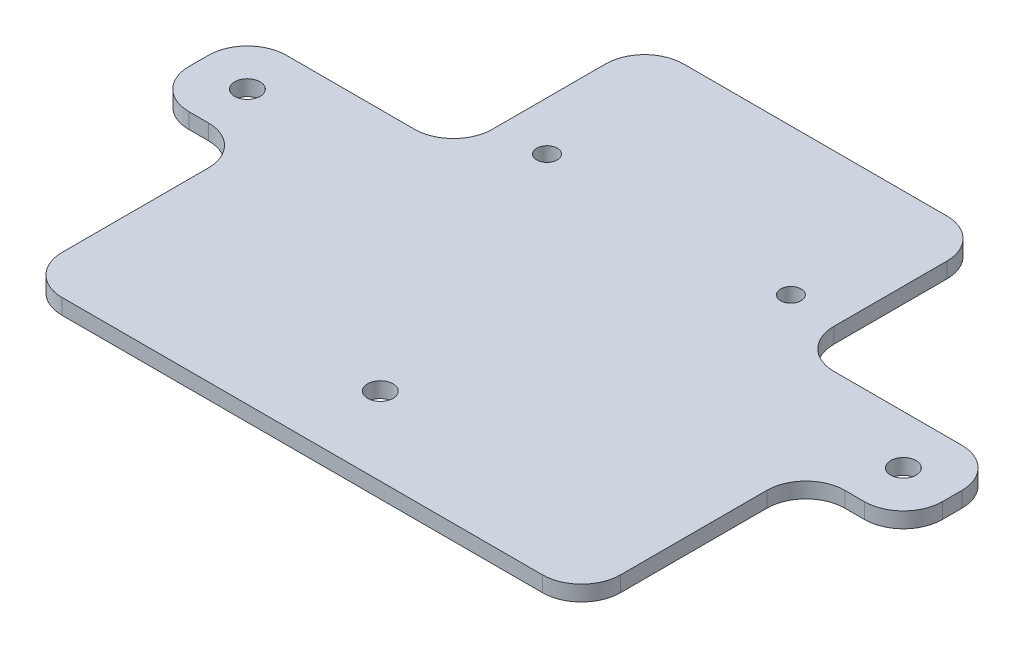
ISO-10303-21;
HEADER;
FILE_DESCRIPTION(('STEP AP214'),'2;1');
FILE_NAME('part.step','',(''),(''),'','','');
FILE_SCHEMA(('AUTOMOTIVE_DESIGN { 1 0 10303 214 1 1 1 1 }'));
ENDSEC;
DATA;
#1=APPLICATION_CONTEXT('core data for automotive mechanical design processes');
#2=APPLICATION_PROTOCOL_DEFINITION('international standard','automotive_design',2000,#1);
#3=PRODUCT_CONTEXT('',#1,'mechanical');
#4=PRODUCT('Part','Part','',(#3));
#5=PRODUCT_RELATED_PRODUCT_CATEGORY('part','',(#4));
#6=PRODUCT_DEFINITION_FORMATION('','',#4);
#7=PRODUCT_DEFINITION_CONTEXT('part definition',#1,'design');
#8=PRODUCT_DEFINITION('design','',#6,#7);
#9=PRODUCT_DEFINITION_SHAPE('','',#8);
#10=(LENGTH_UNIT() NAMED_UNIT(*) SI_UNIT(.MILLI.,.METRE.));
#11=(NAMED_UNIT(*) PLANE_ANGLE_UNIT() SI_UNIT($,.RADIAN.));
#12=(NAMED_UNIT(*) SI_UNIT($,.STERADIAN.) SOLID_ANGLE_UNIT());
#13=UNCERTAINTY_MEASURE_WITH_UNIT(LENGTH_MEASURE(1.E-05),#10,'distance_accuracy_value','');
#14=(GEOMETRIC_REPRESENTATION_CONTEXT(3) GLOBAL_UNCERTAINTY_ASSIGNED_CONTEXT((#13)) GLOBAL_UNIT_ASSIGNED_CONTEXT((#10,
#11,#12)) REPRESENTATION_CONTEXT('',''));
#15=CARTESIAN_POINT('',(0.,0.,0.));
#16=DIRECTION('',(0.,0.,1.));
#17=DIRECTION('',(1.,0.,0.));
#18=AXIS2_PLACEMENT_3D('',#15,#16,#17);
#19=CARTESIAN_POINT('',(0.,3.175,0.));
#20=DIRECTION('',(0.,1.,0.));
#21=DIRECTION('',(0.,0.,1.));
#22=AXIS2_PLACEMENT_3D('',#19,#20,#21);
#23=PLANE('',#22);
#24=CARTESIAN_POINT('',(67.25,3.175,94.175));
#25=DIRECTION('',(0.,1.,0.));
#26=DIRECTION('',(0.,0.,1.));
#27=AXIS2_PLACEMENT_3D('',#24,#25,#26);
#28=CIRCLE('',#27,2.6);
#29=CARTESIAN_POINT('',(67.25,3.175,96.775));
#30=VERTEX_POINT('',#29);
#31=EDGE_CURVE('E753',#30,#30,#28,.T.);
#32=ORIENTED_EDGE('',*,*,#31,.F.);
#33=EDGE_LOOP('',(#32));
#34=FACE_BOUND('',#33,.T.);
#35=CARTESIAN_POINT('',(25.,3.175,75.));
#36=DIRECTION('',(0.,1.,0.));
#37=DIRECTION('',(0.,0.,1.));
#38=AXIS2_PLACEMENT_3D('',#35,#36,#37);
#39=CIRCLE('',#38,2.1);
#40=CARTESIAN_POINT('',(25.,3.175,77.1));
#41=VERTEX_POINT('',#40);
#42=EDGE_CURVE('E738',#41,#41,#39,.T.);
#43=ORIENTED_EDGE('',*,*,#42,.F.);
#44=EDGE_LOOP('',(#43));
#45=FACE_BOUND('',#44,.T.);
#46=DIRECTION('',(-1.,0.,0.));
#47=VECTOR('',#46,1.);
#48=CARTESIAN_POINT('',(-35.,3.175,84.175));
#49=LINE('',#48,#47);
#50=CARTESIAN_POINT('',(-43.,3.175,84.175));
#51=VERTEX_POINT('',#50);
#52=CARTESIAN_POINT('',(-69.25,3.175,84.175));
#53=VERTEX_POINT('',#52);
#54=EDGE_CURVE('E217',#51,#53,#49,.T.);
#55=ORIENTED_EDGE('',*,*,#54,.T.);
#56=CARTESIAN_POINT('',(-69.25,3.175,92.175));
#57=DIRECTION('',(0.,1.,0.));
#58=DIRECTION('',(0.,0.,1.));
#59=AXIS2_PLACEMENT_3D('',#56,#57,#58);
#60=CIRCLE('',#59,8.);
#61=CARTESIAN_POINT('',(-77.25,3.175,92.175));
#62=VERTEX_POINT('',#61);
#63=EDGE_CURVE('E302',#53,#62,#60,.T.);
#64=ORIENTED_EDGE('',*,*,#63,.T.);
#65=DIRECTION('',(0.,0.,1.));
#66=VECTOR('',#65,1.);
#67=CARTESIAN_POINT('',(-77.25,3.175,84.175));
#68=LINE('',#67,#66);
#69=CARTESIAN_POINT('',(-77.25,3.175,96.175));
#70=VERTEX_POINT('',#69);
#71=EDGE_CURVE('E386',#62,#70,#68,.T.);
#72=ORIENTED_EDGE('',*,*,#71,.T.);
#73=CARTESIAN_POINT('',(-69.25,3.175,96.175));
#74=DIRECTION('',(0.,1.,0.));
#75=DIRECTION('',(0.,0.,1.));
#76=AXIS2_PLACEMENT_3D('',#73,#74,#75);
#77=CIRCLE('',#76,8.);
#78=CARTESIAN_POINT('',(-69.25,3.175,104.175));
#79=VERTEX_POINT('',#78);
#80=EDGE_CURVE('E300',#70,#79,#77,.T.);
#81=ORIENTED_EDGE('',*,*,#80,.T.);
#82=DIRECTION('',(1.,0.,0.));
#83=VECTOR('',#82,1.);
#84=CARTESIAN_POINT('',(-77.25,3.175,104.175));
#85=LINE('',#84,#83);
#86=CARTESIAN_POINT('',(-65.25,3.175,104.175));
#87=VERTEX_POINT('',#86);
#88=EDGE_CURVE('E389',#79,#87,#85,.T.);
#89=ORIENTED_EDGE('',*,*,#88,.T.);
#90=CARTESIAN_POINT('',(-65.25,3.175,112.175));
#91=DIRECTION('',(0.,1.,0.));
#92=DIRECTION('',(0.,0.,1.));
#93=AXIS2_PLACEMENT_3D('',#90,#91,#92);
#94=CIRCLE('',#93,8.);
#95=CARTESIAN_POINT('',(-57.25,3.175,112.175));
#96=VERTEX_POINT('',#95);
#97=EDGE_CURVE('E352',#87,#96,#94,.F.);
#98=ORIENTED_EDGE('',*,*,#97,.T.);
#99=DIRECTION('',(0.,0.,1.));
#100=VECTOR('',#99,1.);
#101=CARTESIAN_POINT('',(-57.25,3.175,104.175));
#102=LINE('',#101,#100);
#103=CARTESIAN_POINT('',(-57.25,3.175,142.175));
#104=VERTEX_POINT('',#103);
#105=EDGE_CURVE('E392',#96,#104,#102,.T.);
#106=ORIENTED_EDGE('',*,*,#105,.T.);
#107=CARTESIAN_POINT('',(-49.25,3.175,142.175));
#108=DIRECTION('',(0.,1.,0.));
#109=DIRECTION('',(0.,0.,1.));
#110=AXIS2_PLACEMENT_3D('',#107,#108,#109);
#111=CIRCLE('',#110,8.);
#112=CARTESIAN_POINT('',(-49.25,3.175,150.175));
#113=VERTEX_POINT('',#112);
#114=EDGE_CURVE('E298',#104,#113,#111,.T.);
#115=ORIENTED_EDGE('',*,*,#114,.T.);
#116=DIRECTION('',(1.,0.,0.));
#117=VECTOR('',#116,1.);
#118=CARTESIAN_POINT('',(-57.25,3.175,150.175));
#119=LINE('',#118,#117);
#120=CARTESIAN_POINT('',(49.25,3.175,150.175));
#121=VERTEX_POINT('',#120);
#122=EDGE_CURVE('E396',#113,#121,#119,.T.);
#123=ORIENTED_EDGE('',*,*,#122,.T.);
#124=CARTESIAN_POINT('',(49.25,3.175,142.175));
#125=DIRECTION('',(0.,1.,0.));
#126=DIRECTION('',(0.,0.,1.));
#127=AXIS2_PLACEMENT_3D('',#124,#125,#126);
#128=CIRCLE('',#127,8.);
#129=CARTESIAN_POINT('',(57.25,3.175,142.175));
#130=VERTEX_POINT('',#129);
#131=EDGE_CURVE('E295',#121,#130,#128,.T.);
#132=ORIENTED_EDGE('',*,*,#131,.T.);
#133=DIRECTION('',(0.,0.,-1.));
#134=VECTOR('',#133,1.);
#135=CARTESIAN_POINT('',(57.25,3.175,104.175));
#136=LINE('',#135,#134);
#137=CARTESIAN_POINT('',(57.25,3.175,112.175));
#138=VERTEX_POINT('',#137);
#139=EDGE_CURVE('E399',#130,#138,#136,.T.);
#140=ORIENTED_EDGE('',*,*,#139,.T.);
#141=CARTESIAN_POINT('',(65.25,3.175,112.175));
#142=DIRECTION('',(0.,1.,0.));
#143=DIRECTION('',(0.,0.,1.));
#144=AXIS2_PLACEMENT_3D('',#141,#142,#143);
#145=CIRCLE('',#144,8.);
#146=CARTESIAN_POINT('',(65.25,3.175,104.175));
#147=VERTEX_POINT('',#146);
#148=EDGE_CURVE('E356',#138,#147,#145,.F.);
#149=ORIENTED_EDGE('',*,*,#148,.T.);
#150=DIRECTION('',(1.,0.,0.));
#151=VECTOR('',#150,1.);
#152=CARTESIAN_POINT('',(77.25,3.175,104.175));
#153=LINE('',#152,#151);
#154=CARTESIAN_POINT('',(69.25,3.175,104.175));
#155=VERTEX_POINT('',#154);
#156=EDGE_CURVE('E403',#147,#155,#153,.T.);
#157=ORIENTED_EDGE('',*,*,#156,.T.);
#158=CARTESIAN_POINT('',(69.25,3.175,96.175));
#159=DIRECTION('',(0.,1.,0.));
#160=DIRECTION('',(0.,0.,1.));
#161=AXIS2_PLACEMENT_3D('',#158,#159,#160);
#162=CIRCLE('',#161,8.);
#163=CARTESIAN_POINT('',(77.25,3.175,96.175));
#164=VERTEX_POINT('',#163);
#165=EDGE_CURVE('E293',#155,#164,#162,.T.);
#166=ORIENTED_EDGE('',*,*,#165,.T.);
#167=DIRECTION('',(0.,0.,-1.));
#168=VECTOR('',#167,1.);
#169=CARTESIAN_POINT('',(77.25,3.175,84.175));
#170=LINE('',#169,#168);
#171=CARTESIAN_POINT('',(77.25,3.175,92.175));
#172=VERTEX_POINT('',#171);
#173=EDGE_CURVE('E406',#164,#172,#170,.T.);
#174=ORIENTED_EDGE('',*,*,#173,.T.);
#175=CARTESIAN_POINT('',(69.25,3.175,92.175));
#176=DIRECTION('',(0.,1.,0.));
#177=DIRECTION('',(0.,0.,1.));
#178=AXIS2_PLACEMENT_3D('',#175,#176,#177);
#179=CIRCLE('',#178,8.);
#180=CARTESIAN_POINT('',(69.25,3.175,84.175));
#181=VERTEX_POINT('',#180);
#182=EDGE_CURVE('E57',#172,#181,#179,.T.);
#183=ORIENTED_EDGE('',*,*,#182,.T.);
#184=DIRECTION('',(-1.,0.,0.));
#185=VECTOR('',#184,1.);
#186=CARTESIAN_POINT('',(35.,3.175,84.175));
#187=LINE('',#186,#185);
#188=CARTESIAN_POINT('',(43.,3.175,84.175));
#189=VERTEX_POINT('',#188);
#190=EDGE_CURVE('E259',#181,#189,#187,.T.);
#191=ORIENTED_EDGE('',*,*,#190,.T.);
#192=CARTESIAN_POINT('',(43.,3.175,76.175));
#193=DIRECTION('',(0.,1.,0.));
#194=DIRECTION('',(0.,0.,1.));
#195=AXIS2_PLACEMENT_3D('',#192,#193,#194);
#196=CIRCLE('',#195,8.);
#197=CARTESIAN_POINT('',(35.,3.175,76.175));
#198=VERTEX_POINT('',#197);
#199=EDGE_CURVE('E11',#189,#198,#196,.F.);
#200=ORIENTED_EDGE('',*,*,#199,.T.);
#201=DIRECTION('',(0.,0.,-1.));
#202=VECTOR('',#201,1.);
#203=CARTESIAN_POINT('',(35.,3.175,45.));
#204=LINE('',#203,#202);
#205=CARTESIAN_POINT('',(35.,3.175,53.));
#206=VERTEX_POINT('',#205);
#207=EDGE_CURVE('E258',#198,#206,#204,.T.);
#208=ORIENTED_EDGE('',*,*,#207,.T.);
#209=CARTESIAN_POINT('',(27.,3.175,53.));
#210=DIRECTION('',(0.,1.,0.));
#211=DIRECTION('',(0.,0.,1.));
#212=AXIS2_PLACEMENT_3D('',#209,#210,#211);
#213=CIRCLE('',#212,8.);
#214=CARTESIAN_POINT('',(27.,3.175,45.));
#215=VERTEX_POINT('',#214);
#216=EDGE_CURVE('E287',#206,#215,#213,.T.);
#217=ORIENTED_EDGE('',*,*,#216,.T.);
#218=DIRECTION('',(-1.,0.,0.));
#219=VECTOR('',#218,1.);
#220=CARTESIAN_POINT('',(-35.,3.175,45.));
#221=LINE('',#220,#219);
#222=CARTESIAN_POINT('',(-27.,3.175,45.));
#223=VERTEX_POINT('',#222);
#224=EDGE_CURVE('E374',#215,#223,#221,.T.);
#225=ORIENTED_EDGE('',*,*,#224,.T.);
#226=CARTESIAN_POINT('',(-27.,3.175,53.));
#227=DIRECTION('',(0.,1.,0.));
#228=DIRECTION('',(0.,0.,1.));
#229=AXIS2_PLACEMENT_3D('',#226,#227,#228);
#230=CIRCLE('',#229,8.);
#231=CARTESIAN_POINT('',(-35.,3.175,53.));
#232=VERTEX_POINT('',#231);
#233=EDGE_CURVE('E289',#223,#232,#230,.T.);
#234=ORIENTED_EDGE('',*,*,#233,.T.);
#235=DIRECTION('',(0.,0.,1.));
#236=VECTOR('',#235,1.);
#237=CARTESIAN_POINT('',(-35.,3.175,45.));
#238=LINE('',#237,#236);
#239=CARTESIAN_POINT('',(-35.,3.175,76.175));
#240=VERTEX_POINT('',#239);
#241=EDGE_CURVE('E377',#232,#240,#238,.T.);
#242=ORIENTED_EDGE('',*,*,#241,.T.);
#243=CARTESIAN_POINT('',(-43.,3.175,76.175));
#244=DIRECTION('',(0.,1.,0.));
#245=DIRECTION('',(0.,0.,1.));
#246=AXIS2_PLACEMENT_3D('',#243,#244,#245);
#247=CIRCLE('',#246,8.);
#248=EDGE_CURVE('E207',#240,#51,#247,.F.);
#249=ORIENTED_EDGE('',*,*,#248,.T.);
#250=EDGE_LOOP('',(#55,#64,#72,#81,#89,#98,#106,#115,#123,#132,#140,#149,#157,#166,#174,#183,
#191,#200,#208,#217,#225,#234,#242,#249));
#251=FACE_BOUND('',#250,.T.);
#252=CARTESIAN_POINT('',(-25.,3.175,75.));
#253=DIRECTION('',(0.,1.,0.));
#254=DIRECTION('',(0.,0.,1.));
#255=AXIS2_PLACEMENT_3D('',#252,#253,#254);
#256=CIRCLE('',#255,2.1);
#257=CARTESIAN_POINT('',(-25.,3.175,77.1));
#258=VERTEX_POINT('',#257);
#259=EDGE_CURVE('E409',#258,#258,#256,.T.);
#260=ORIENTED_EDGE('',*,*,#259,.F.);
#261=EDGE_LOOP('',(#260));
#262=FACE_BOUND('',#261,.T.);
#263=CARTESIAN_POINT('',(-67.25,3.175,94.175));
#264=DIRECTION('',(0.,1.,0.));
#265=DIRECTION('',(0.,0.,1.));
#266=AXIS2_PLACEMENT_3D('',#263,#264,#265);
#267=CIRCLE('',#266,2.6);
#268=CARTESIAN_POINT('',(-67.25,3.175,96.775));
#269=VERTEX_POINT('',#268);
#270=EDGE_CURVE('E747',#269,#269,#267,.T.);
#271=ORIENTED_EDGE('',*,*,#270,.F.);
#272=EDGE_LOOP('',(#271));
#273=FACE_BOUND('',#272,.T.);
#274=CARTESIAN_POINT('',(0.,3.175,134.175));
#275=DIRECTION('',(0.,1.,0.));
#276=DIRECTION('',(0.,0.,1.));
#277=AXIS2_PLACEMENT_3D('',#274,#275,#276);
#278=CIRCLE('',#277,2.6);
#279=CARTESIAN_POINT('',(0.,3.175,136.775));
#280=VERTEX_POINT('',#279);
#281=EDGE_CURVE('E760',#280,#280,#278,.T.);
#282=ORIENTED_EDGE('',*,*,#281,.F.);
#283=EDGE_LOOP('',(#282));
#284=FACE_BOUND('',#283,.T.);
#285=ADVANCED_FACE('F35',(#34,#45,#251,#262,#273,#284),#23,.T.);
#286=CARTESIAN_POINT('',(0.,0.,0.));
#287=DIRECTION('',(0.,1.,0.));
#288=DIRECTION('',(0.,0.,1.));
#289=AXIS2_PLACEMENT_3D('',#286,#287,#288);
#290=PLANE('',#289);
#291=CARTESIAN_POINT('',(67.25,0.,94.175));
#292=DIRECTION('',(0.,1.,0.));
#293=DIRECTION('',(0.,0.,1.));
#294=AXIS2_PLACEMENT_3D('',#291,#292,#293);
#295=CIRCLE('',#294,2.6);
#296=CARTESIAN_POINT('',(67.25,0.,96.775));
#297=VERTEX_POINT('',#296);
#298=EDGE_CURVE('E756',#297,#297,#295,.T.);
#299=ORIENTED_EDGE('',*,*,#298,.T.);
#300=EDGE_LOOP('',(#299));
#301=FACE_BOUND('',#300,.T.);
#302=CARTESIAN_POINT('',(25.,0.,75.));
#303=DIRECTION('',(0.,1.,0.));
#304=DIRECTION('',(0.,0.,1.));
#305=AXIS2_PLACEMENT_3D('',#302,#303,#304);
#306=CIRCLE('',#305,2.1);
#307=CARTESIAN_POINT('',(25.,0.,77.1));
#308=VERTEX_POINT('',#307);
#309=EDGE_CURVE('E742',#308,#308,#306,.T.);
#310=ORIENTED_EDGE('',*,*,#309,.T.);
#311=EDGE_LOOP('',(#310));
#312=FACE_BOUND('',#311,.T.);
#313=DIRECTION('',(0.,0.,1.));
#314=VECTOR('',#313,1.);
#315=CARTESIAN_POINT('',(-77.25,0.,84.175));
#316=LINE('',#315,#314);
#317=CARTESIAN_POINT('',(-77.25,0.,92.175));
#318=VERTEX_POINT('',#317);
#319=CARTESIAN_POINT('',(-77.25,0.,96.175));
#320=VERTEX_POINT('',#319);
#321=EDGE_CURVE('E225',#318,#320,#316,.T.);
#322=ORIENTED_EDGE('',*,*,#321,.F.);
#323=CARTESIAN_POINT('',(-69.25,0.,92.175));
#324=DIRECTION('',(0.,1.,0.));
#325=DIRECTION('',(0.,0.,1.));
#326=AXIS2_PLACEMENT_3D('',#323,#324,#325);
#327=CIRCLE('',#326,8.);
#328=CARTESIAN_POINT('',(-69.25,0.,84.175));
#329=VERTEX_POINT('',#328);
#330=EDGE_CURVE('E224',#318,#329,#327,.F.);
#331=ORIENTED_EDGE('',*,*,#330,.T.);
#332=DIRECTION('',(-1.,0.,0.));
#333=VECTOR('',#332,1.);
#334=CARTESIAN_POINT('',(-35.,0.,84.175));
#335=LINE('',#334,#333);
#336=CARTESIAN_POINT('',(-43.,0.,84.175));
#337=VERTEX_POINT('',#336);
#338=EDGE_CURVE('E214',#337,#329,#335,.T.);
#339=ORIENTED_EDGE('',*,*,#338,.F.);
#340=CARTESIAN_POINT('',(-43.,0.,76.175));
#341=DIRECTION('',(0.,1.,0.));
#342=DIRECTION('',(0.,0.,1.));
#343=AXIS2_PLACEMENT_3D('',#340,#341,#342);
#344=CIRCLE('',#343,8.);
#345=CARTESIAN_POINT('',(-35.,0.,76.175));
#346=VERTEX_POINT('',#345);
#347=EDGE_CURVE('E197',#337,#346,#344,.T.);
#348=ORIENTED_EDGE('',*,*,#347,.T.);
#349=DIRECTION('',(0.,0.,1.));
#350=VECTOR('',#349,1.);
#351=CARTESIAN_POINT('',(-35.,0.,45.));
#352=LINE('',#351,#350);
#353=CARTESIAN_POINT('',(-35.,0.,53.));
#354=VERTEX_POINT('',#353);
#355=EDGE_CURVE('E226',#354,#346,#352,.T.);
#356=ORIENTED_EDGE('',*,*,#355,.F.);
#357=CARTESIAN_POINT('',(-27.,0.,53.));
#358=DIRECTION('',(0.,1.,0.));
#359=DIRECTION('',(0.,0.,1.));
#360=AXIS2_PLACEMENT_3D('',#357,#358,#359);
#361=CIRCLE('',#360,8.);
#362=CARTESIAN_POINT('',(-27.,0.,45.));
#363=VERTEX_POINT('',#362);
#364=EDGE_CURVE('E271',#354,#363,#361,.F.);
#365=ORIENTED_EDGE('',*,*,#364,.T.);
#366=DIRECTION('',(-1.,0.,0.));
#367=VECTOR('',#366,1.);
#368=CARTESIAN_POINT('',(-35.,0.,45.));
#369=LINE('',#368,#367);
#370=CARTESIAN_POINT('',(27.,0.,45.));
#371=VERTEX_POINT('',#370);
#372=EDGE_CURVE('E231',#371,#363,#369,.T.);
#373=ORIENTED_EDGE('',*,*,#372,.F.);
#374=CARTESIAN_POINT('',(27.,0.,53.));
#375=DIRECTION('',(0.,1.,0.));
#376=DIRECTION('',(0.,0.,1.));
#377=AXIS2_PLACEMENT_3D('',#374,#375,#376);
#378=CIRCLE('',#377,8.);
#379=CARTESIAN_POINT('',(35.,0.,53.));
#380=VERTEX_POINT('',#379);
#381=EDGE_CURVE('E269',#371,#380,#378,.F.);
#382=ORIENTED_EDGE('',*,*,#381,.T.);
#383=DIRECTION('',(0.,0.,-1.));
#384=VECTOR('',#383,1.);
#385=CARTESIAN_POINT('',(35.,0.,45.));
#386=LINE('',#385,#384);
#387=CARTESIAN_POINT('',(35.,0.,76.175));
#388=VERTEX_POINT('',#387);
#389=EDGE_CURVE('E360',#388,#380,#386,.T.);
#390=ORIENTED_EDGE('',*,*,#389,.F.);
#391=CARTESIAN_POINT('',(43.,0.,76.175));
#392=DIRECTION('',(0.,1.,0.));
#393=DIRECTION('',(0.,0.,1.));
#394=AXIS2_PLACEMENT_3D('',#391,#392,#393);
#395=CIRCLE('',#394,8.);
#396=CARTESIAN_POINT('',(43.,0.,84.175));
#397=VERTEX_POINT('',#396);
#398=EDGE_CURVE('E43',#388,#397,#395,.T.);
#399=ORIENTED_EDGE('',*,*,#398,.T.);
#400=DIRECTION('',(-1.,0.,0.));
#401=VECTOR('',#400,1.);
#402=CARTESIAN_POINT('',(35.,0.,84.175));
#403=LINE('',#402,#401);
#404=CARTESIAN_POINT('',(69.25,0.,84.175));
#405=VERTEX_POINT('',#404);
#406=EDGE_CURVE('E256',#405,#397,#403,.T.);
#407=ORIENTED_EDGE('',*,*,#406,.F.);
#408=CARTESIAN_POINT('',(69.25,0.,92.175));
#409=DIRECTION('',(0.,1.,0.));
#410=DIRECTION('',(0.,0.,1.));
#411=AXIS2_PLACEMENT_3D('',#408,#409,#410);
#412=CIRCLE('',#411,8.);
#413=CARTESIAN_POINT('',(77.25,0.,92.175));
#414=VERTEX_POINT('',#413);
#415=EDGE_CURVE('E274',#405,#414,#412,.F.);
#416=ORIENTED_EDGE('',*,*,#415,.T.);
#417=DIRECTION('',(0.,0.,-1.));
#418=VECTOR('',#417,1.);
#419=CARTESIAN_POINT('',(77.25,0.,84.175));
#420=LINE('',#419,#418);
#421=CARTESIAN_POINT('',(77.25,0.,96.175));
#422=VERTEX_POINT('',#421);
#423=EDGE_CURVE('E252',#422,#414,#420,.T.);
#424=ORIENTED_EDGE('',*,*,#423,.F.);
#425=CARTESIAN_POINT('',(69.25,0.,96.175));
#426=DIRECTION('',(0.,1.,0.));
#427=DIRECTION('',(0.,0.,1.));
#428=AXIS2_PLACEMENT_3D('',#425,#426,#427);
#429=CIRCLE('',#428,8.);
#430=CARTESIAN_POINT('',(69.25,0.,104.175));
#431=VERTEX_POINT('',#430);
#432=EDGE_CURVE('E276',#422,#431,#429,.F.);
#433=ORIENTED_EDGE('',*,*,#432,.T.);
#434=DIRECTION('',(1.,0.,0.));
#435=VECTOR('',#434,1.);
#436=CARTESIAN_POINT('',(77.25,0.,104.175));
#437=LINE('',#436,#435);
#438=CARTESIAN_POINT('',(65.25,0.,104.175));
#439=VERTEX_POINT('',#438);
#440=EDGE_CURVE('E248',#439,#431,#437,.T.);
#441=ORIENTED_EDGE('',*,*,#440,.F.);
#442=CARTESIAN_POINT('',(65.25,0.,112.175));
#443=DIRECTION('',(0.,1.,0.));
#444=DIRECTION('',(0.,0.,1.));
#445=AXIS2_PLACEMENT_3D('',#442,#443,#444);
#446=CIRCLE('',#445,8.);
#447=CARTESIAN_POINT('',(57.25,0.,112.175));
#448=VERTEX_POINT('',#447);
#449=EDGE_CURVE('E354',#439,#448,#446,.T.);
#450=ORIENTED_EDGE('',*,*,#449,.T.);
#451=DIRECTION('',(0.,0.,-1.));
#452=VECTOR('',#451,1.);
#453=CARTESIAN_POINT('',(57.25,0.,104.175));
#454=LINE('',#453,#452);
#455=CARTESIAN_POINT('',(57.25,0.,142.175));
#456=VERTEX_POINT('',#455);
#457=EDGE_CURVE('E245',#456,#448,#454,.T.);
#458=ORIENTED_EDGE('',*,*,#457,.F.);
#459=CARTESIAN_POINT('',(49.25,0.,142.175));
#460=DIRECTION('',(0.,1.,0.));
#461=DIRECTION('',(0.,0.,1.));
#462=AXIS2_PLACEMENT_3D('',#459,#460,#461);
#463=CIRCLE('',#462,8.);
#464=CARTESIAN_POINT('',(49.25,0.,150.175));
#465=VERTEX_POINT('',#464);
#466=EDGE_CURVE('E279',#456,#465,#463,.F.);
#467=ORIENTED_EDGE('',*,*,#466,.T.);
#468=DIRECTION('',(1.,0.,0.));
#469=VECTOR('',#468,1.);
#470=CARTESIAN_POINT('',(-57.25,0.,150.175));
#471=LINE('',#470,#469);
#472=CARTESIAN_POINT('',(-49.25,0.,150.175));
#473=VERTEX_POINT('',#472);
#474=EDGE_CURVE('E242',#473,#465,#471,.T.);
#475=ORIENTED_EDGE('',*,*,#474,.F.);
#476=CARTESIAN_POINT('',(-49.25,0.,142.175));
#477=DIRECTION('',(0.,1.,0.));
#478=DIRECTION('',(0.,0.,1.));
#479=AXIS2_PLACEMENT_3D('',#476,#477,#478);
#480=CIRCLE('',#479,8.);
#481=CARTESIAN_POINT('',(-57.25,0.,142.175));
#482=VERTEX_POINT('',#481);
#483=EDGE_CURVE('E281',#473,#482,#480,.F.);
#484=ORIENTED_EDGE('',*,*,#483,.T.);
#485=DIRECTION('',(0.,0.,1.));
#486=VECTOR('',#485,1.);
#487=CARTESIAN_POINT('',(-57.25,0.,104.175));
#488=LINE('',#487,#486);
#489=CARTESIAN_POINT('',(-57.25,0.,112.175));
#490=VERTEX_POINT('',#489);
#491=EDGE_CURVE('E238',#490,#482,#488,.T.);
#492=ORIENTED_EDGE('',*,*,#491,.F.);
#493=CARTESIAN_POINT('',(-65.25,0.,112.175));
#494=DIRECTION('',(0.,1.,0.));
#495=DIRECTION('',(0.,0.,1.));
#496=AXIS2_PLACEMENT_3D('',#493,#494,#495);
#497=CIRCLE('',#496,8.);
#498=CARTESIAN_POINT('',(-65.25,0.,104.175));
#499=VERTEX_POINT('',#498);
#500=EDGE_CURVE('E350',#490,#499,#497,.T.);
#501=ORIENTED_EDGE('',*,*,#500,.T.);
#502=DIRECTION('',(1.,0.,0.));
#503=VECTOR('',#502,1.);
#504=CARTESIAN_POINT('',(-77.25,0.,104.175));
#505=LINE('',#504,#503);
#506=CARTESIAN_POINT('',(-69.25,0.,104.175));
#507=VERTEX_POINT('',#506);
#508=EDGE_CURVE('E229',#507,#499,#505,.T.);
#509=ORIENTED_EDGE('',*,*,#508,.F.);
#510=CARTESIAN_POINT('',(-69.25,0.,96.175));
#511=DIRECTION('',(0.,1.,0.));
#512=DIRECTION('',(0.,0.,1.));
#513=AXIS2_PLACEMENT_3D('',#510,#511,#512);
#514=CIRCLE('',#513,8.);
#515=EDGE_CURVE('E284',#507,#320,#514,.F.);
#516=ORIENTED_EDGE('',*,*,#515,.T.);
#517=EDGE_LOOP('',(#322,#331,#339,#348,#356,#365,#373,#382,#390,#399,#407,#416,#424,#433,#441,
#450,#458,#467,#475,#484,#492,#501,#509,#516));
#518=FACE_BOUND('',#517,.T.);
#519=CARTESIAN_POINT('',(-25.,0.,75.));
#520=DIRECTION('',(0.,1.,0.));
#521=DIRECTION('',(0.,0.,1.));
#522=AXIS2_PLACEMENT_3D('',#519,#520,#521);
#523=CIRCLE('',#522,2.1);
#524=CARTESIAN_POINT('',(-25.,0.,77.1));
#525=VERTEX_POINT('',#524);
#526=EDGE_CURVE('E380',#525,#525,#523,.T.);
#527=ORIENTED_EDGE('',*,*,#526,.T.);
#528=EDGE_LOOP('',(#527));
#529=FACE_BOUND('',#528,.T.);
#530=CARTESIAN_POINT('',(-67.25,0.,94.175));
#531=DIRECTION('',(0.,1.,0.));
#532=DIRECTION('',(0.,0.,1.));
#533=AXIS2_PLACEMENT_3D('',#530,#531,#532);
#534=CIRCLE('',#533,2.6);
#535=CARTESIAN_POINT('',(-67.25,0.,96.775));
#536=VERTEX_POINT('',#535);
#537=EDGE_CURVE('E750',#536,#536,#534,.T.);
#538=ORIENTED_EDGE('',*,*,#537,.T.);
#539=EDGE_LOOP('',(#538));
#540=FACE_BOUND('',#539,.T.);
#541=CARTESIAN_POINT('',(0.,0.,134.175));
#542=DIRECTION('',(0.,1.,0.));
#543=DIRECTION('',(0.,0.,1.));
#544=AXIS2_PLACEMENT_3D('',#541,#542,#543);
#545=CIRCLE('',#544,2.6);
#546=CARTESIAN_POINT('',(0.,0.,136.775));
#547=VERTEX_POINT('',#546);
#548=EDGE_CURVE('E763',#547,#547,#545,.T.);
#549=ORIENTED_EDGE('',*,*,#548,.T.);
#550=EDGE_LOOP('',(#549));
#551=FACE_BOUND('',#550,.T.);
#552=ADVANCED_FACE('F222',(#301,#312,#518,#529,#540,#551),#290,.F.);
#553=CARTESIAN_POINT('',(35.,3.175,45.));
#554=DIRECTION('',(-1.,0.,0.));
#555=DIRECTION('',(0.,0.,1.));
#556=AXIS2_PLACEMENT_3D('',#553,#554,#555);
#557=PLANE('',#556);
#558=ORIENTED_EDGE('',*,*,#207,.F.);
#559=DIRECTION('',(0.,-1.,0.));
#560=VECTOR('',#559,1.);
#561=CARTESIAN_POINT('',(35.,0.,76.175));
#562=LINE('',#561,#560);
#563=EDGE_CURVE('E342',#198,#388,#562,.T.);
#564=ORIENTED_EDGE('',*,*,#563,.T.);
#565=ORIENTED_EDGE('',*,*,#389,.T.);
#566=DIRECTION('',(0.,-1.,0.));
#567=VECTOR('',#566,1.);
#568=CARTESIAN_POINT('',(35.,3.175,53.));
#569=LINE('',#568,#567);
#570=EDGE_CURVE('E340',#380,#206,#569,.F.);
#571=ORIENTED_EDGE('',*,*,#570,.T.);
#572=EDGE_LOOP('',(#558,#564,#565,#571));
#573=FACE_BOUND('',#572,.T.);
#574=ADVANCED_FACE('F372',(#573),#557,.F.);
#575=CARTESIAN_POINT('',(-35.,3.175,45.));
#576=DIRECTION('',(0.,0.,1.));
#577=DIRECTION('',(1.,0.,0.));
#578=AXIS2_PLACEMENT_3D('',#575,#576,#577);
#579=PLANE('',#578);
#580=ORIENTED_EDGE('',*,*,#372,.T.);
#581=DIRECTION('',(0.,-1.,0.));
#582=VECTOR('',#581,1.);
#583=CARTESIAN_POINT('',(-27.,3.175,45.));
#584=LINE('',#583,#582);
#585=EDGE_CURVE('E208',#363,#223,#584,.F.);
#586=ORIENTED_EDGE('',*,*,#585,.T.);
#587=ORIENTED_EDGE('',*,*,#224,.F.);
#588=DIRECTION('',(0.,-1.,0.));
#589=VECTOR('',#588,1.);
#590=CARTESIAN_POINT('',(27.,3.175,45.));
#591=LINE('',#590,#589);
#592=EDGE_CURVE('E345',#215,#371,#591,.T.);
#593=ORIENTED_EDGE('',*,*,#592,.T.);
#594=EDGE_LOOP('',(#580,#586,#587,#593));
#595=FACE_BOUND('',#594,.T.);
#596=ADVANCED_FACE('F414',(#595),#579,.F.);
#597=CARTESIAN_POINT('',(-35.,3.175,45.));
#598=DIRECTION('',(1.,0.,0.));
#599=DIRECTION('',(0.,0.,-1.));
#600=AXIS2_PLACEMENT_3D('',#597,#598,#599);
#601=PLANE('',#600);
#602=ORIENTED_EDGE('',*,*,#355,.T.);
#603=DIRECTION('',(0.,-1.,0.));
#604=VECTOR('',#603,1.);
#605=CARTESIAN_POINT('',(-35.,3.175,76.175));
#606=LINE('',#605,#604);
#607=EDGE_CURVE('E202',#346,#240,#606,.F.);
#608=ORIENTED_EDGE('',*,*,#607,.T.);
#609=ORIENTED_EDGE('',*,*,#241,.F.);
#610=DIRECTION('',(0.,-1.,0.));
#611=VECTOR('',#610,1.);
#612=CARTESIAN_POINT('',(-35.,3.175,53.));
#613=LINE('',#612,#611);
#614=EDGE_CURVE('E218',#232,#354,#613,.T.);
#615=ORIENTED_EDGE('',*,*,#614,.T.);
#616=EDGE_LOOP('',(#602,#608,#609,#615));
#617=FACE_BOUND('',#616,.T.);
#618=ADVANCED_FACE('F423',(#617),#601,.F.);
#619=CARTESIAN_POINT('',(-35.,3.175,84.175));
#620=DIRECTION('',(0.,0.,1.));
#621=DIRECTION('',(1.,0.,0.));
#622=AXIS2_PLACEMENT_3D('',#619,#620,#621);
#623=PLANE('',#622);
#624=ORIENTED_EDGE('',*,*,#54,.F.);
#625=DIRECTION('',(0.,-1.,0.));
#626=VECTOR('',#625,1.);
#627=CARTESIAN_POINT('',(-43.,0.,84.175));
#628=LINE('',#627,#626);
#629=EDGE_CURVE('E201',#51,#337,#628,.T.);
#630=ORIENTED_EDGE('',*,*,#629,.T.);
#631=ORIENTED_EDGE('',*,*,#338,.T.);
#632=DIRECTION('',(0.,-1.,0.));
#633=VECTOR('',#632,1.);
#634=CARTESIAN_POINT('',(-69.25,3.175,84.175));
#635=LINE('',#634,#633);
#636=EDGE_CURVE('E219',#329,#53,#635,.F.);
#637=ORIENTED_EDGE('',*,*,#636,.T.);
#638=EDGE_LOOP('',(#624,#630,#631,#637));
#639=FACE_BOUND('',#638,.T.);
#640=ADVANCED_FACE('F213',(#639),#623,.F.);
#641=CARTESIAN_POINT('',(-77.25,3.175,84.175));
#642=DIRECTION('',(1.,0.,0.));
#643=DIRECTION('',(0.,0.,-1.));
#644=AXIS2_PLACEMENT_3D('',#641,#642,#643);
#645=PLANE('',#644);
#646=ORIENTED_EDGE('',*,*,#71,.F.);
#647=DIRECTION('',(0.,-1.,0.));
#648=VECTOR('',#647,1.);
#649=CARTESIAN_POINT('',(-77.25,3.175,92.175));
#650=LINE('',#649,#648);
#651=EDGE_CURVE('E266',#62,#318,#650,.T.);
#652=ORIENTED_EDGE('',*,*,#651,.T.);
#653=ORIENTED_EDGE('',*,*,#321,.T.);
#654=DIRECTION('',(0.,-1.,0.));
#655=VECTOR('',#654,1.);
#656=CARTESIAN_POINT('',(-77.25,3.175,96.175));
#657=LINE('',#656,#655);
#658=EDGE_CURVE('E264',#320,#70,#657,.F.);
#659=ORIENTED_EDGE('',*,*,#658,.T.);
#660=EDGE_LOOP('',(#646,#652,#653,#659));
#661=FACE_BOUND('',#660,.T.);
#662=ADVANCED_FACE('F430',(#661),#645,.F.);
#663=CARTESIAN_POINT('',(-77.25,3.175,104.175));
#664=DIRECTION('',(0.,0.,-1.));
#665=DIRECTION('',(-1.,0.,0.));
#666=AXIS2_PLACEMENT_3D('',#663,#664,#665);
#667=PLANE('',#666);
#668=ORIENTED_EDGE('',*,*,#88,.F.);
#669=DIRECTION('',(0.,-1.,0.));
#670=VECTOR('',#669,1.);
#671=CARTESIAN_POINT('',(-69.25,3.175,104.175));
#672=LINE('',#671,#670);
#673=EDGE_CURVE('E307',#79,#507,#672,.T.);
#674=ORIENTED_EDGE('',*,*,#673,.T.);
#675=ORIENTED_EDGE('',*,*,#508,.T.);
#676=DIRECTION('',(0.,-1.,0.));
#677=VECTOR('',#676,1.);
#678=CARTESIAN_POINT('',(-65.25,3.175,104.175));
#679=LINE('',#678,#677);
#680=EDGE_CURVE('E304',#499,#87,#679,.F.);
#681=ORIENTED_EDGE('',*,*,#680,.T.);
#682=EDGE_LOOP('',(#668,#674,#675,#681));
#683=FACE_BOUND('',#682,.T.);
#684=ADVANCED_FACE('F468',(#683),#667,.F.);
#685=CARTESIAN_POINT('',(-57.25,3.175,104.175));
#686=DIRECTION('',(1.,0.,0.));
#687=DIRECTION('',(0.,0.,-1.));
#688=AXIS2_PLACEMENT_3D('',#685,#686,#687);
#689=PLANE('',#688);
#690=ORIENTED_EDGE('',*,*,#105,.F.);
#691=DIRECTION('',(0.,-1.,0.));
#692=VECTOR('',#691,1.);
#693=CARTESIAN_POINT('',(-57.25,0.,112.175));
#694=LINE('',#693,#692);
#695=EDGE_CURVE('E313',#96,#490,#694,.T.);
#696=ORIENTED_EDGE('',*,*,#695,.T.);
#697=ORIENTED_EDGE('',*,*,#491,.T.);
#698=DIRECTION('',(0.,-1.,0.));
#699=VECTOR('',#698,1.);
#700=CARTESIAN_POINT('',(-57.25,3.175,142.175));
#701=LINE('',#700,#699);
#702=EDGE_CURVE('E310',#482,#104,#701,.F.);
#703=ORIENTED_EDGE('',*,*,#702,.T.);
#704=EDGE_LOOP('',(#690,#696,#697,#703));
#705=FACE_BOUND('',#704,.T.);
#706=ADVANCED_FACE('F464',(#705),#689,.F.);
#707=CARTESIAN_POINT('',(-57.25,3.175,150.175));
#708=DIRECTION('',(0.,0.,-1.));
#709=DIRECTION('',(-1.,0.,0.));
#710=AXIS2_PLACEMENT_3D('',#707,#708,#709);
#711=PLANE('',#710);
#712=ORIENTED_EDGE('',*,*,#122,.F.);
#713=DIRECTION('',(0.,-1.,0.));
#714=VECTOR('',#713,1.);
#715=CARTESIAN_POINT('',(-49.25,3.175,150.175));
#716=LINE('',#715,#714);
#717=EDGE_CURVE('E318',#113,#473,#716,.T.);
#718=ORIENTED_EDGE('',*,*,#717,.T.);
#719=ORIENTED_EDGE('',*,*,#474,.T.);
#720=DIRECTION('',(0.,-1.,0.));
#721=VECTOR('',#720,1.);
#722=CARTESIAN_POINT('',(49.25,3.175,150.175));
#723=LINE('',#722,#721);
#724=EDGE_CURVE('E316',#465,#121,#723,.F.);
#725=ORIENTED_EDGE('',*,*,#724,.T.);
#726=EDGE_LOOP('',(#712,#718,#719,#725));
#727=FACE_BOUND('',#726,.T.);
#728=ADVANCED_FACE('F460',(#727),#711,.F.);
#729=CARTESIAN_POINT('',(57.25,3.175,104.175));
#730=DIRECTION('',(-1.,0.,0.));
#731=DIRECTION('',(0.,0.,1.));
#732=AXIS2_PLACEMENT_3D('',#729,#730,#731);
#733=PLANE('',#732);
#734=ORIENTED_EDGE('',*,*,#139,.F.);
#735=DIRECTION('',(0.,-1.,0.));
#736=VECTOR('',#735,1.);
#737=CARTESIAN_POINT('',(57.25,3.175,142.175));
#738=LINE('',#737,#736);
#739=EDGE_CURVE('E323',#130,#456,#738,.T.);
#740=ORIENTED_EDGE('',*,*,#739,.T.);
#741=ORIENTED_EDGE('',*,*,#457,.T.);
#742=DIRECTION('',(0.,-1.,0.));
#743=VECTOR('',#742,1.);
#744=CARTESIAN_POINT('',(57.25,3.175,112.175));
#745=LINE('',#744,#743);
#746=EDGE_CURVE('E321',#448,#138,#745,.F.);
#747=ORIENTED_EDGE('',*,*,#746,.T.);
#748=EDGE_LOOP('',(#734,#740,#741,#747));
#749=FACE_BOUND('',#748,.T.);
#750=ADVANCED_FACE('F456',(#749),#733,.F.);
#751=CARTESIAN_POINT('',(77.25,3.175,104.175));
#752=DIRECTION('',(0.,0.,-1.));
#753=DIRECTION('',(-1.,0.,0.));
#754=AXIS2_PLACEMENT_3D('',#751,#752,#753);
#755=PLANE('',#754);
#756=ORIENTED_EDGE('',*,*,#156,.F.);
#757=DIRECTION('',(0.,-1.,0.));
#758=VECTOR('',#757,1.);
#759=CARTESIAN_POINT('',(65.25,0.,104.175));
#760=LINE('',#759,#758);
#761=EDGE_CURVE('E328',#147,#439,#760,.T.);
#762=ORIENTED_EDGE('',*,*,#761,.T.);
#763=ORIENTED_EDGE('',*,*,#440,.T.);
#764=DIRECTION('',(0.,-1.,0.));
#765=VECTOR('',#764,1.);
#766=CARTESIAN_POINT('',(69.25,3.175,104.175));
#767=LINE('',#766,#765);
#768=EDGE_CURVE('E326',#431,#155,#767,.F.);
#769=ORIENTED_EDGE('',*,*,#768,.T.);
#770=EDGE_LOOP('',(#756,#762,#763,#769));
#771=FACE_BOUND('',#770,.T.);
#772=ADVANCED_FACE('F452',(#771),#755,.F.);
#773=CARTESIAN_POINT('',(77.25,3.175,84.175));
#774=DIRECTION('',(-1.,0.,0.));
#775=DIRECTION('',(0.,0.,1.));
#776=AXIS2_PLACEMENT_3D('',#773,#774,#775);
#777=PLANE('',#776);
#778=ORIENTED_EDGE('',*,*,#173,.F.);
#779=DIRECTION('',(0.,-1.,0.));
#780=VECTOR('',#779,1.);
#781=CARTESIAN_POINT('',(77.25,3.175,96.175));
#782=LINE('',#781,#780);
#783=EDGE_CURVE('E333',#164,#422,#782,.T.);
#784=ORIENTED_EDGE('',*,*,#783,.T.);
#785=ORIENTED_EDGE('',*,*,#423,.T.);
#786=DIRECTION('',(0.,-1.,0.));
#787=VECTOR('',#786,1.);
#788=CARTESIAN_POINT('',(77.25,3.175,92.175));
#789=LINE('',#788,#787);
#790=EDGE_CURVE('E331',#414,#172,#789,.F.);
#791=ORIENTED_EDGE('',*,*,#790,.T.);
#792=EDGE_LOOP('',(#778,#784,#785,#791));
#793=FACE_BOUND('',#792,.T.);
#794=ADVANCED_FACE('F449',(#793),#777,.F.);
#795=CARTESIAN_POINT('',(35.,3.175,84.175));
#796=DIRECTION('',(0.,0.,1.));
#797=DIRECTION('',(1.,0.,0.));
#798=AXIS2_PLACEMENT_3D('',#795,#796,#797);
#799=PLANE('',#798);
#800=ORIENTED_EDGE('',*,*,#190,.F.);
#801=DIRECTION('',(0.,-1.,0.));
#802=VECTOR('',#801,1.);
#803=CARTESIAN_POINT('',(69.25,3.175,84.175));
#804=LINE('',#803,#802);
#805=EDGE_CURVE('E337',#181,#405,#804,.T.);
#806=ORIENTED_EDGE('',*,*,#805,.T.);
#807=ORIENTED_EDGE('',*,*,#406,.T.);
#808=DIRECTION('',(0.,-1.,0.));
#809=VECTOR('',#808,1.);
#810=CARTESIAN_POINT('',(43.,3.175,84.175));
#811=LINE('',#810,#809);
#812=EDGE_CURVE('E50',#397,#189,#811,.F.);
#813=ORIENTED_EDGE('',*,*,#812,.T.);
#814=EDGE_LOOP('',(#800,#806,#807,#813));
#815=FACE_BOUND('',#814,.T.);
#816=ADVANCED_FACE('F363',(#815),#799,.F.);
#817=CARTESIAN_POINT('',(-25.,3.175,75.));
#818=DIRECTION('',(0.,-1.,0.));
#819=DIRECTION('',(0.,0.,-1.));
#820=AXIS2_PLACEMENT_3D('',#817,#818,#819);
#821=CYLINDRICAL_SURFACE('',#820,2.1);
#822=ORIENTED_EDGE('',*,*,#259,.T.);
#823=EDGE_LOOP('',(#822));
#824=FACE_BOUND('',#823,.T.);
#825=ORIENTED_EDGE('',*,*,#526,.F.);
#826=EDGE_LOOP('',(#825));
#827=FACE_BOUND('',#826,.T.);
#828=ADVANCED_FACE('F444',(#824,#827),#821,.F.);
#829=CARTESIAN_POINT('',(25.,3.175,75.));
#830=DIRECTION('',(0.,-1.,0.));
#831=DIRECTION('',(0.,0.,-1.));
#832=AXIS2_PLACEMENT_3D('',#829,#830,#831);
#833=CYLINDRICAL_SURFACE('',#832,2.1);
#834=ORIENTED_EDGE('',*,*,#42,.T.);
#835=EDGE_LOOP('',(#834));
#836=FACE_BOUND('',#835,.T.);
#837=ORIENTED_EDGE('',*,*,#309,.F.);
#838=EDGE_LOOP('',(#837));
#839=FACE_BOUND('',#838,.T.);
#840=ADVANCED_FACE('F709',(#836,#839),#833,.F.);
#841=CARTESIAN_POINT('',(-67.25,3.175,94.175));
#842=DIRECTION('',(0.,-1.,0.));
#843=DIRECTION('',(0.,0.,-1.));
#844=AXIS2_PLACEMENT_3D('',#841,#842,#843);
#845=CYLINDRICAL_SURFACE('',#844,2.6);
#846=ORIENTED_EDGE('',*,*,#270,.T.);
#847=EDGE_LOOP('',(#846));
#848=FACE_BOUND('',#847,.T.);
#849=ORIENTED_EDGE('',*,*,#537,.F.);
#850=EDGE_LOOP('',(#849));
#851=FACE_BOUND('',#850,.T.);
#852=ADVANCED_FACE('F697',(#848,#851),#845,.F.);
#853=CARTESIAN_POINT('',(67.25,3.175,94.175));
#854=DIRECTION('',(0.,-1.,0.));
#855=DIRECTION('',(0.,0.,-1.));
#856=AXIS2_PLACEMENT_3D('',#853,#854,#855);
#857=CYLINDRICAL_SURFACE('',#856,2.6);
#858=ORIENTED_EDGE('',*,*,#31,.T.);
#859=EDGE_LOOP('',(#858));
#860=FACE_BOUND('',#859,.T.);
#861=ORIENTED_EDGE('',*,*,#298,.F.);
#862=EDGE_LOOP('',(#861));
#863=FACE_BOUND('',#862,.T.);
#864=ADVANCED_FACE('F686',(#860,#863),#857,.F.);
#865=CARTESIAN_POINT('',(0.,3.175,134.175));
#866=DIRECTION('',(0.,-1.,0.));
#867=DIRECTION('',(0.,0.,-1.));
#868=AXIS2_PLACEMENT_3D('',#865,#866,#867);
#869=CYLINDRICAL_SURFACE('',#868,2.6);
#870=ORIENTED_EDGE('',*,*,#281,.T.);
#871=EDGE_LOOP('',(#870));
#872=FACE_BOUND('',#871,.T.);
#873=ORIENTED_EDGE('',*,*,#548,.F.);
#874=EDGE_LOOP('',(#873));
#875=FACE_BOUND('',#874,.T.);
#876=ADVANCED_FACE('F494',(#872,#875),#869,.F.);
#877=CARTESIAN_POINT('',(-43.,3.175,76.175));
#878=DIRECTION('',(0.,1.,0.));
#879=DIRECTION('',(0.,0.,1.));
#880=AXIS2_PLACEMENT_3D('',#877,#878,#879);
#881=CYLINDRICAL_SURFACE('',#880,8.);
#882=ORIENTED_EDGE('',*,*,#248,.F.);
#883=ORIENTED_EDGE('',*,*,#607,.F.);
#884=ORIENTED_EDGE('',*,*,#347,.F.);
#885=ORIENTED_EDGE('',*,*,#629,.F.);
#886=EDGE_LOOP('',(#882,#883,#884,#885));
#887=FACE_BOUND('',#886,.T.);
#888=ADVANCED_FACE('F200',(#887),#881,.F.);
#889=CARTESIAN_POINT('',(-69.25,3.175,92.175));
#890=DIRECTION('',(0.,-1.,0.));
#891=DIRECTION('',(0.,0.,-1.));
#892=AXIS2_PLACEMENT_3D('',#889,#890,#891);
#893=CYLINDRICAL_SURFACE('',#892,8.);
#894=ORIENTED_EDGE('',*,*,#63,.F.);
#895=ORIENTED_EDGE('',*,*,#636,.F.);
#896=ORIENTED_EDGE('',*,*,#330,.F.);
#897=ORIENTED_EDGE('',*,*,#651,.F.);
#898=EDGE_LOOP('',(#894,#895,#896,#897));
#899=FACE_BOUND('',#898,.T.);
#900=ADVANCED_FACE('F483',(#899),#893,.T.);
#901=CARTESIAN_POINT('',(-69.25,3.175,96.175));
#902=DIRECTION('',(0.,-1.,0.));
#903=DIRECTION('',(0.,0.,-1.));
#904=AXIS2_PLACEMENT_3D('',#901,#902,#903);
#905=CYLINDRICAL_SURFACE('',#904,8.);
#906=ORIENTED_EDGE('',*,*,#80,.F.);
#907=ORIENTED_EDGE('',*,*,#658,.F.);
#908=ORIENTED_EDGE('',*,*,#515,.F.);
#909=ORIENTED_EDGE('',*,*,#673,.F.);
#910=EDGE_LOOP('',(#906,#907,#908,#909));
#911=FACE_BOUND('',#910,.T.);
#912=ADVANCED_FACE('F485',(#911),#905,.T.);
#913=CARTESIAN_POINT('',(-65.25,3.175,112.175));
#914=DIRECTION('',(0.,1.,0.));
#915=DIRECTION('',(0.,0.,1.));
#916=AXIS2_PLACEMENT_3D('',#913,#914,#915);
#917=CYLINDRICAL_SURFACE('',#916,8.);
#918=ORIENTED_EDGE('',*,*,#97,.F.);
#919=ORIENTED_EDGE('',*,*,#680,.F.);
#920=ORIENTED_EDGE('',*,*,#500,.F.);
#921=ORIENTED_EDGE('',*,*,#695,.F.);
#922=EDGE_LOOP('',(#918,#919,#920,#921));
#923=FACE_BOUND('',#922,.T.);
#924=ADVANCED_FACE('F491',(#923),#917,.F.);
#925=CARTESIAN_POINT('',(-49.25,3.175,142.175));
#926=DIRECTION('',(0.,-1.,0.));
#927=DIRECTION('',(0.,0.,-1.));
#928=AXIS2_PLACEMENT_3D('',#925,#926,#927);
#929=CYLINDRICAL_SURFACE('',#928,8.);
#930=ORIENTED_EDGE('',*,*,#114,.F.);
#931=ORIENTED_EDGE('',*,*,#702,.F.);
#932=ORIENTED_EDGE('',*,*,#483,.F.);
#933=ORIENTED_EDGE('',*,*,#717,.F.);
#934=EDGE_LOOP('',(#930,#931,#932,#933));
#935=FACE_BOUND('',#934,.T.);
#936=ADVANCED_FACE('F500',(#935),#929,.T.);
#937=CARTESIAN_POINT('',(49.25,3.175,142.175));
#938=DIRECTION('',(0.,-1.,0.));
#939=DIRECTION('',(0.,0.,-1.));
#940=AXIS2_PLACEMENT_3D('',#937,#938,#939);
#941=CYLINDRICAL_SURFACE('',#940,8.);
#942=ORIENTED_EDGE('',*,*,#131,.F.);
#943=ORIENTED_EDGE('',*,*,#724,.F.);
#944=ORIENTED_EDGE('',*,*,#466,.F.);
#945=ORIENTED_EDGE('',*,*,#739,.F.);
#946=EDGE_LOOP('',(#942,#943,#944,#945));
#947=FACE_BOUND('',#946,.T.);
#948=ADVANCED_FACE('F504',(#947),#941,.T.);
#949=CARTESIAN_POINT('',(65.25,3.175,112.175));
#950=DIRECTION('',(0.,1.,0.));
#951=DIRECTION('',(0.,0.,1.));
#952=AXIS2_PLACEMENT_3D('',#949,#950,#951);
#953=CYLINDRICAL_SURFACE('',#952,8.);
#954=ORIENTED_EDGE('',*,*,#148,.F.);
#955=ORIENTED_EDGE('',*,*,#746,.F.);
#956=ORIENTED_EDGE('',*,*,#449,.F.);
#957=ORIENTED_EDGE('',*,*,#761,.F.);
#958=EDGE_LOOP('',(#954,#955,#956,#957));
#959=FACE_BOUND('',#958,.T.);
#960=ADVANCED_FACE('F508',(#959),#953,.F.);
#961=CARTESIAN_POINT('',(69.25,3.175,96.175));
#962=DIRECTION('',(0.,-1.,0.));
#963=DIRECTION('',(0.,0.,-1.));
#964=AXIS2_PLACEMENT_3D('',#961,#962,#963);
#965=CYLINDRICAL_SURFACE('',#964,8.);
#966=ORIENTED_EDGE('',*,*,#165,.F.);
#967=ORIENTED_EDGE('',*,*,#768,.F.);
#968=ORIENTED_EDGE('',*,*,#432,.F.);
#969=ORIENTED_EDGE('',*,*,#783,.F.);
#970=EDGE_LOOP('',(#966,#967,#968,#969));
#971=FACE_BOUND('',#970,.T.);
#972=ADVANCED_FACE('F512',(#971),#965,.T.);
#973=CARTESIAN_POINT('',(69.25,3.175,92.175));
#974=DIRECTION('',(0.,-1.,0.));
#975=DIRECTION('',(0.,0.,-1.));
#976=AXIS2_PLACEMENT_3D('',#973,#974,#975);
#977=CYLINDRICAL_SURFACE('',#976,8.);
#978=ORIENTED_EDGE('',*,*,#182,.F.);
#979=ORIENTED_EDGE('',*,*,#790,.F.);
#980=ORIENTED_EDGE('',*,*,#415,.F.);
#981=ORIENTED_EDGE('',*,*,#805,.F.);
#982=EDGE_LOOP('',(#978,#979,#980,#981));
#983=FACE_BOUND('',#982,.T.);
#984=ADVANCED_FACE('F516',(#983),#977,.T.);
#985=CARTESIAN_POINT('',(43.,3.175,76.175));
#986=DIRECTION('',(0.,1.,0.));
#987=DIRECTION('',(0.,0.,1.));
#988=AXIS2_PLACEMENT_3D('',#985,#986,#987);
#989=CYLINDRICAL_SURFACE('',#988,8.);
#990=ORIENTED_EDGE('',*,*,#199,.F.);
#991=ORIENTED_EDGE('',*,*,#812,.F.);
#992=ORIENTED_EDGE('',*,*,#398,.F.);
#993=ORIENTED_EDGE('',*,*,#563,.F.);
#994=EDGE_LOOP('',(#990,#991,#992,#993));
#995=FACE_BOUND('',#994,.T.);
#996=ADVANCED_FACE('F366',(#995),#989,.F.);
#997=CARTESIAN_POINT('',(-27.,3.175,53.));
#998=DIRECTION('',(0.,-1.,0.));
#999=DIRECTION('',(0.,0.,-1.));
#1000=AXIS2_PLACEMENT_3D('',#997,#998,#999);
#1001=CYLINDRICAL_SURFACE('',#1000,8.);
#1002=ORIENTED_EDGE('',*,*,#233,.F.);
#1003=ORIENTED_EDGE('',*,*,#585,.F.);
#1004=ORIENTED_EDGE('',*,*,#364,.F.);
#1005=ORIENTED_EDGE('',*,*,#614,.F.);
#1006=EDGE_LOOP('',(#1002,#1003,#1004,#1005));
#1007=FACE_BOUND('',#1006,.T.);
#1008=ADVANCED_FACE('F419',(#1007),#1001,.T.);
#1009=CARTESIAN_POINT('',(27.,3.175,53.));
#1010=DIRECTION('',(0.,-1.,0.));
#1011=DIRECTION('',(0.,0.,-1.));
#1012=AXIS2_PLACEMENT_3D('',#1009,#1010,#1011);
#1013=CYLINDRICAL_SURFACE('',#1012,8.);
#1014=ORIENTED_EDGE('',*,*,#216,.F.);
#1015=ORIENTED_EDGE('',*,*,#570,.F.);
#1016=ORIENTED_EDGE('',*,*,#381,.F.);
#1017=ORIENTED_EDGE('',*,*,#592,.F.);
#1018=EDGE_LOOP('',(#1014,#1015,#1016,#1017));
#1019=FACE_BOUND('',#1018,.T.);
#1020=ADVANCED_FACE('F37',(#1019),#1013,.T.);
#1021=CLOSED_SHELL('',(#285,#552,#574,#596,#618,#640,#662,#684,#706,#728,#750,#772,#794,#816,
#828,#840,#852,#864,#876,#888,#900,#912,#924,#936,#948,#960,#972,#984,#996,#1008,#1020));
#1022=MANIFOLD_SOLID_BREP('B2',#1021);
#1023=ADVANCED_BREP_SHAPE_REPRESENTATION('',(#18,#1022),#14);
#1024=SHAPE_DEFINITION_REPRESENTATION(#9,#1023);
ENDSEC;
END-ISO-10303-21;
